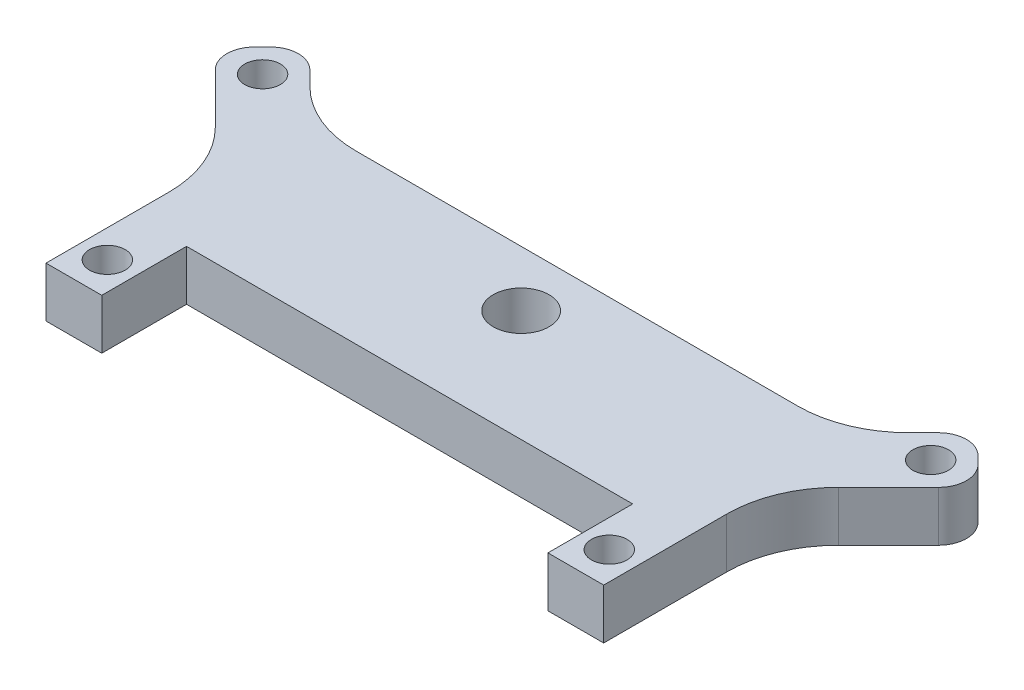
ISO-10303-21;
HEADER;
FILE_DESCRIPTION(('STEP AP214'),'2;1');
FILE_NAME('part.step','',(''),(''),'','','');
FILE_SCHEMA(('AUTOMOTIVE_DESIGN { 1 0 10303 214 1 1 1 1 }'));
ENDSEC;
DATA;
#1=APPLICATION_CONTEXT('core data for automotive mechanical design processes');
#2=APPLICATION_PROTOCOL_DEFINITION('international standard','automotive_design',2000,#1);
#3=PRODUCT_CONTEXT('',#1,'mechanical');
#4=PRODUCT('Part','Part','',(#3));
#5=PRODUCT_RELATED_PRODUCT_CATEGORY('part','',(#4));
#6=PRODUCT_DEFINITION_FORMATION('','',#4);
#7=PRODUCT_DEFINITION_CONTEXT('part definition',#1,'design');
#8=PRODUCT_DEFINITION('design','',#6,#7);
#9=PRODUCT_DEFINITION_SHAPE('','',#8);
#10=(LENGTH_UNIT() NAMED_UNIT(*) SI_UNIT(.MILLI.,.METRE.));
#11=(NAMED_UNIT(*) PLANE_ANGLE_UNIT() SI_UNIT($,.RADIAN.));
#12=(NAMED_UNIT(*) SI_UNIT($,.STERADIAN.) SOLID_ANGLE_UNIT());
#13=UNCERTAINTY_MEASURE_WITH_UNIT(LENGTH_MEASURE(1.E-05),#10,'distance_accuracy_value','');
#14=(GEOMETRIC_REPRESENTATION_CONTEXT(3) GLOBAL_UNCERTAINTY_ASSIGNED_CONTEXT((#13)) GLOBAL_UNIT_ASSIGNED_CONTEXT((#10,
#11,#12)) REPRESENTATION_CONTEXT('',''));
#15=CARTESIAN_POINT('',(0.,0.,0.));
#16=DIRECTION('',(0.,0.,1.));
#17=DIRECTION('',(1.,0.,0.));
#18=AXIS2_PLACEMENT_3D('',#15,#16,#17);
#19=CARTESIAN_POINT('',(0.,4.5,0.));
#20=DIRECTION('',(0.,-1.,0.));
#21=DIRECTION('',(0.,0.,-1.));
#22=AXIS2_PLACEMENT_3D('',#19,#20,#21);
#23=PLANE('',#22);
#24=DIRECTION('',(-0.707106781186549,0.,0.707106781186546));
#25=VECTOR('',#24,1.);
#26=CARTESIAN_POINT('',(-29.9497474683061,4.5,-21.0104076400856));
#27=LINE('',#26,#25);
#28=CARTESIAN_POINT('',(-31.7175144212725,4.5,-19.2426406871193));
#29=VERTEX_POINT('',#28);
#30=CARTESIAN_POINT('',(-32.424621202459,4.5,-18.5355339059327));
#31=VERTEX_POINT('',#30);
#32=EDGE_CURVE('E516',#29,#31,#27,.T.);
#33=ORIENTED_EDGE('',*,*,#32,.T.);
#34=CARTESIAN_POINT('',(-30.6568542494927,4.5,-16.7677669529663));
#35=DIRECTION('',(0.,-1.,0.));
#36=DIRECTION('',(0.,0.,-1.));
#37=AXIS2_PLACEMENT_3D('',#34,#35,#36);
#38=CIRCLE('',#37,2.5);
#39=CARTESIAN_POINT('',(-32.424621202459,4.5,-15.));
#40=VERTEX_POINT('',#39);
#41=EDGE_CURVE('E315',#31,#40,#38,.F.);
#42=ORIENTED_EDGE('',*,*,#41,.T.);
#43=DIRECTION('',(0.707106781186546,0.,0.707106781186549));
#44=VECTOR('',#43,1.);
#45=CARTESIAN_POINT('',(-34.1923881554254,4.5,-16.7677669529664));
#46=LINE('',#45,#44);
#47=CARTESIAN_POINT('',(-27.9289321881346,4.5,-10.5043109856756));
#48=VERTEX_POINT('',#47);
#49=EDGE_CURVE('E522',#40,#48,#46,.T.);
#50=ORIENTED_EDGE('',*,*,#49,.T.);
#51=CARTESIAN_POINT('',(-35.0000000000001,4.5,-3.43324317381012));
#52=DIRECTION('',(0.,-1.,0.));
#53=DIRECTION('',(0.,0.,-1.));
#54=AXIS2_PLACEMENT_3D('',#51,#52,#53);
#55=CIRCLE('',#54,10.);
#56=CARTESIAN_POINT('',(-25.0000000000001,4.5,-3.43324317381051));
#57=VERTEX_POINT('',#56);
#58=EDGE_CURVE('E275',#48,#57,#55,.T.);
#59=ORIENTED_EDGE('',*,*,#58,.T.);
#60=DIRECTION('',(0.,0.,1.));
#61=VECTOR('',#60,1.);
#62=CARTESIAN_POINT('',(-25.0000000000003,4.5,-7.57537879754122));
#63=LINE('',#62,#61);
#64=CARTESIAN_POINT('',(-24.9999999999997,4.5,7.60000000000024));
#65=VERTEX_POINT('',#64);
#66=EDGE_CURVE('E527',#57,#65,#63,.T.);
#67=ORIENTED_EDGE('',*,*,#66,.T.);
#68=DIRECTION('',(1.,0.,0.));
#69=VECTOR('',#68,1.);
#70=CARTESIAN_POINT('',(-24.9999999999997,4.5,7.60000000000024));
#71=LINE('',#70,#69);
#72=CARTESIAN_POINT('',(-20.,4.5,7.60000000000007));
#73=VERTEX_POINT('',#72);
#74=EDGE_CURVE('E210',#65,#73,#71,.T.);
#75=ORIENTED_EDGE('',*,*,#74,.T.);
#76=DIRECTION('',(0.,0.,-1.));
#77=VECTOR('',#76,1.);
#78=CARTESIAN_POINT('',(-20.,4.5,7.60000000000007));
#79=LINE('',#78,#77);
#80=CARTESIAN_POINT('',(-20.,4.5,0.));
#81=VERTEX_POINT('',#80);
#82=EDGE_CURVE('E204',#73,#81,#79,.T.);
#83=ORIENTED_EDGE('',*,*,#82,.T.);
#84=DIRECTION('',(1.,0.,0.));
#85=VECTOR('',#84,1.);
#86=CARTESIAN_POINT('',(-20.,4.5,0.));
#87=LINE('',#86,#85);
#88=CARTESIAN_POINT('',(20.,4.5,0.));
#89=VERTEX_POINT('',#88);
#90=EDGE_CURVE('E193',#81,#89,#87,.T.);
#91=ORIENTED_EDGE('',*,*,#90,.T.);
#92=DIRECTION('',(0.,0.,1.));
#93=VECTOR('',#92,1.);
#94=CARTESIAN_POINT('',(20.,4.5,0.));
#95=LINE('',#94,#93);
#96=CARTESIAN_POINT('',(20.,4.5,7.60000000000011));
#97=VERTEX_POINT('',#96);
#98=EDGE_CURVE('E203',#89,#97,#95,.T.);
#99=ORIENTED_EDGE('',*,*,#98,.T.);
#100=DIRECTION('',(1.,0.,0.));
#101=VECTOR('',#100,1.);
#102=CARTESIAN_POINT('',(20.,4.5,7.60000000000011));
#103=LINE('',#102,#101);
#104=CARTESIAN_POINT('',(25.,4.5,7.60000000000008));
#105=VERTEX_POINT('',#104);
#106=EDGE_CURVE('E404',#97,#105,#103,.T.);
#107=ORIENTED_EDGE('',*,*,#106,.T.);
#108=DIRECTION('',(0.,0.,-1.));
#109=VECTOR('',#108,1.);
#110=CARTESIAN_POINT('',(25.,4.5,7.60000000000008));
#111=LINE('',#110,#109);
#112=CARTESIAN_POINT('',(25.,4.5,-3.43324317380999));
#113=VERTEX_POINT('',#112);
#114=EDGE_CURVE('E545',#105,#113,#111,.T.);
#115=ORIENTED_EDGE('',*,*,#114,.T.);
#116=CARTESIAN_POINT('',(35.,4.5,-3.43324317380999));
#117=DIRECTION('',(0.,-1.,0.));
#118=DIRECTION('',(0.,0.,-1.));
#119=AXIS2_PLACEMENT_3D('',#116,#117,#118);
#120=CIRCLE('',#119,10.);
#121=CARTESIAN_POINT('',(27.9289321881345,4.5,-10.5043109856755));
#122=VERTEX_POINT('',#121);
#123=EDGE_CURVE('E281',#113,#122,#120,.T.);
#124=ORIENTED_EDGE('',*,*,#123,.T.);
#125=DIRECTION('',(0.707106781186549,0.,-0.707106781186546));
#126=VECTOR('',#125,1.);
#127=CARTESIAN_POINT('',(25.,4.5,-7.57537879754096));
#128=LINE('',#127,#126);
#129=CARTESIAN_POINT('',(32.4246212024591,4.5,-15.));
#130=VERTEX_POINT('',#129);
#131=EDGE_CURVE('E343',#122,#130,#128,.T.);
#132=ORIENTED_EDGE('',*,*,#131,.T.);
#133=CARTESIAN_POINT('',(30.6568542494927,4.5,-16.7677669529663));
#134=DIRECTION('',(0.,-1.,0.));
#135=DIRECTION('',(0.,0.,-1.));
#136=AXIS2_PLACEMENT_3D('',#133,#134,#135);
#137=CIRCLE('',#136,2.5);
#138=CARTESIAN_POINT('',(32.4246212024591,4.5,-18.5355339059327));
#139=VERTEX_POINT('',#138);
#140=EDGE_CURVE('E307',#130,#139,#137,.F.);
#141=ORIENTED_EDGE('',*,*,#140,.T.);
#142=DIRECTION('',(-0.707106781186545,0.,-0.707106781186549));
#143=VECTOR('',#142,1.);
#144=CARTESIAN_POINT('',(34.1923881554254,4.5,-16.7677669529663));
#145=LINE('',#144,#143);
#146=CARTESIAN_POINT('',(31.7175144212725,4.5,-19.2426406871193));
#147=VERTEX_POINT('',#146);
#148=EDGE_CURVE('E334',#139,#147,#145,.T.);
#149=ORIENTED_EDGE('',*,*,#148,.T.);
#150=CARTESIAN_POINT('',(29.9497474683061,4.5,-17.4748737341529));
#151=DIRECTION('',(0.,-1.,0.));
#152=DIRECTION('',(0.,0.,-1.));
#153=AXIS2_PLACEMENT_3D('',#150,#151,#152);
#154=CIRCLE('',#153,2.5);
#155=CARTESIAN_POINT('',(28.1819805153398,4.5,-19.2426406871193));
#156=VERTEX_POINT('',#155);
#157=EDGE_CURVE('E65',#147,#156,#154,.F.);
#158=ORIENTED_EDGE('',*,*,#157,.T.);
#159=DIRECTION('',(-0.707106781186549,0.,0.707106781186546));
#160=VECTOR('',#159,1.);
#161=CARTESIAN_POINT('',(29.9497474683062,4.5,-21.0104076400856));
#162=LINE('',#161,#160);
#163=CARTESIAN_POINT('',(26.868272016355,4.5,-17.9289321881345));
#164=VERTEX_POINT('',#163);
#165=EDGE_CURVE('E342',#156,#164,#162,.T.);
#166=ORIENTED_EDGE('',*,*,#165,.T.);
#167=CARTESIAN_POINT('',(19.7972042044895,4.5,-25.));
#168=DIRECTION('',(0.,-1.,0.));
#169=DIRECTION('',(0.,0.,-1.));
#170=AXIS2_PLACEMENT_3D('',#167,#168,#169);
#171=CIRCLE('',#170,10.);
#172=CARTESIAN_POINT('',(19.7972042044895,4.5,-15.));
#173=VERTEX_POINT('',#172);
#174=EDGE_CURVE('E268',#164,#173,#171,.T.);
#175=ORIENTED_EDGE('',*,*,#174,.T.);
#176=DIRECTION('',(-1.,0.,0.));
#177=VECTOR('',#176,1.);
#178=CARTESIAN_POINT('',(23.9393398282205,4.5,-15.));
#179=LINE('',#178,#177);
#180=CARTESIAN_POINT('',(-19.7972042044895,4.5,-15.));
#181=VERTEX_POINT('',#180);
#182=EDGE_CURVE('E529',#173,#181,#179,.T.);
#183=ORIENTED_EDGE('',*,*,#182,.T.);
#184=CARTESIAN_POINT('',(-19.7972042044895,4.5,-25.));
#185=DIRECTION('',(0.,-1.,0.));
#186=DIRECTION('',(0.,0.,-1.));
#187=AXIS2_PLACEMENT_3D('',#184,#185,#186);
#188=CIRCLE('',#187,10.);
#189=CARTESIAN_POINT('',(-26.868272016355,4.5,-17.9289321881345));
#190=VERTEX_POINT('',#189);
#191=EDGE_CURVE('E261',#181,#190,#188,.T.);
#192=ORIENTED_EDGE('',*,*,#191,.T.);
#193=DIRECTION('',(-0.707106781186546,0.,-0.707106781186549));
#194=VECTOR('',#193,1.);
#195=CARTESIAN_POINT('',(-23.9393398282205,4.5,-15.));
#196=LINE('',#195,#194);
#197=CARTESIAN_POINT('',(-28.1819805153397,4.5,-19.2426406871193));
#198=VERTEX_POINT('',#197);
#199=EDGE_CURVE('E518',#190,#198,#196,.T.);
#200=ORIENTED_EDGE('',*,*,#199,.T.);
#201=CARTESIAN_POINT('',(-29.9497474683061,4.5,-17.4748737341529));
#202=DIRECTION('',(0.,-1.,0.));
#203=DIRECTION('',(0.,0.,-1.));
#204=AXIS2_PLACEMENT_3D('',#201,#202,#203);
#205=CIRCLE('',#204,2.5);
#206=EDGE_CURVE('E312',#198,#29,#205,.F.);
#207=ORIENTED_EDGE('',*,*,#206,.T.);
#208=EDGE_LOOP('',(#33,#42,#50,#59,#67,#75,#83,#91,#99,#107,#115,#124,#132,#141,#149,#158,#166,
#175,#183,#192,#200,#207));
#209=FACE_BOUND('',#208,.T.);
#210=CARTESIAN_POINT('',(-22.5,4.5,4.60000000000011));
#211=DIRECTION('',(0.,1.,0.));
#212=DIRECTION('',(0.,0.,1.));
#213=AXIS2_PLACEMENT_3D('',#210,#211,#212);
#214=CIRCLE('',#213,1.60000000000004);
#215=CARTESIAN_POINT('',(-22.5,4.5,6.20000000000015));
#216=VERTEX_POINT('',#215);
#217=EDGE_CURVE('E538',#216,#216,#214,.T.);
#218=ORIENTED_EDGE('',*,*,#217,.F.);
#219=EDGE_LOOP('',(#218));
#220=FACE_BOUND('',#219,.T.);
#221=CARTESIAN_POINT('',(22.5,4.5,4.6));
#222=DIRECTION('',(0.,1.,0.));
#223=DIRECTION('',(0.,0.,1.));
#224=AXIS2_PLACEMENT_3D('',#221,#222,#223);
#225=CIRCLE('',#224,1.60000000000001);
#226=CARTESIAN_POINT('',(22.5,4.5,6.20000000000001));
#227=VERTEX_POINT('',#226);
#228=EDGE_CURVE('E600',#227,#227,#225,.T.);
#229=ORIENTED_EDGE('',*,*,#228,.F.);
#230=EDGE_LOOP('',(#229));
#231=FACE_BOUND('',#230,.T.);
#232=CARTESIAN_POINT('',(29.9497474683061,4.5,-16.7677669529664));
#233=DIRECTION('',(0.,1.,0.));
#234=DIRECTION('',(0.,0.,1.));
#235=AXIS2_PLACEMENT_3D('',#232,#233,#234);
#236=CIRCLE('',#235,1.59999999999999);
#237=CARTESIAN_POINT('',(29.9497474683061,4.5,-15.1677669529664));
#238=VERTEX_POINT('',#237);
#239=EDGE_CURVE('E610',#238,#238,#236,.T.);
#240=ORIENTED_EDGE('',*,*,#239,.F.);
#241=EDGE_LOOP('',(#240));
#242=FACE_BOUND('',#241,.T.);
#243=CARTESIAN_POINT('',(0.,4.5,-10.));
#244=DIRECTION('',(0.,1.,0.));
#245=DIRECTION('',(0.,0.,1.));
#246=AXIS2_PLACEMENT_3D('',#243,#244,#245);
#247=CIRCLE('',#246,2.5);
#248=CARTESIAN_POINT('',(0.,4.5,-7.5));
#249=VERTEX_POINT('',#248);
#250=EDGE_CURVE('E620',#249,#249,#247,.T.);
#251=ORIENTED_EDGE('',*,*,#250,.F.);
#252=EDGE_LOOP('',(#251));
#253=FACE_BOUND('',#252,.T.);
#254=CARTESIAN_POINT('',(-29.9497474683061,4.5,-16.7677669529664));
#255=DIRECTION('',(0.,1.,0.));
#256=DIRECTION('',(0.,0.,1.));
#257=AXIS2_PLACEMENT_3D('',#254,#255,#256);
#258=CIRCLE('',#257,1.6);
#259=CARTESIAN_POINT('',(-29.9497474683061,4.5,-15.1677669529663));
#260=VERTEX_POINT('',#259);
#261=EDGE_CURVE('E630',#260,#260,#258,.T.);
#262=ORIENTED_EDGE('',*,*,#261,.F.);
#263=EDGE_LOOP('',(#262));
#264=FACE_BOUND('',#263,.T.);
#265=ADVANCED_FACE('F41',(#209,#220,#231,#242,#253,#264),#23,.F.);
#266=CARTESIAN_POINT('',(0.,0.,0.));
#267=DIRECTION('',(0.,-1.,0.));
#268=DIRECTION('',(0.,0.,-1.));
#269=AXIS2_PLACEMENT_3D('',#266,#267,#268);
#270=PLANE('',#269);
#271=CARTESIAN_POINT('',(0.,0.,-10.));
#272=DIRECTION('',(0.,1.,0.));
#273=DIRECTION('',(0.,0.,1.));
#274=AXIS2_PLACEMENT_3D('',#271,#272,#273);
#275=CIRCLE('',#274,2.5);
#276=CARTESIAN_POINT('',(0.,0.,-7.5));
#277=VERTEX_POINT('',#276);
#278=EDGE_CURVE('E625',#277,#277,#275,.T.);
#279=ORIENTED_EDGE('',*,*,#278,.T.);
#280=EDGE_LOOP('',(#279));
#281=FACE_BOUND('',#280,.T.);
#282=CARTESIAN_POINT('',(22.5,0.,4.6));
#283=DIRECTION('',(0.,1.,0.));
#284=DIRECTION('',(0.,0.,1.));
#285=AXIS2_PLACEMENT_3D('',#282,#283,#284);
#286=CIRCLE('',#285,1.60000000000001);
#287=CARTESIAN_POINT('',(22.5,0.,6.20000000000001));
#288=VERTEX_POINT('',#287);
#289=EDGE_CURVE('E605',#288,#288,#286,.T.);
#290=ORIENTED_EDGE('',*,*,#289,.T.);
#291=EDGE_LOOP('',(#290));
#292=FACE_BOUND('',#291,.T.);
#293=DIRECTION('',(0.707106781186546,0.,0.707106781186549));
#294=VECTOR('',#293,1.);
#295=CARTESIAN_POINT('',(-34.1923881554254,0.,-16.7677669529664));
#296=LINE('',#295,#294);
#297=CARTESIAN_POINT('',(-32.424621202459,0.,-15.));
#298=VERTEX_POINT('',#297);
#299=CARTESIAN_POINT('',(-27.9289321881346,0.,-10.5043109856756));
#300=VERTEX_POINT('',#299);
#301=EDGE_CURVE('E376',#298,#300,#296,.T.);
#302=ORIENTED_EDGE('',*,*,#301,.F.);
#303=CARTESIAN_POINT('',(-30.6568542494927,0.,-16.7677669529663));
#304=DIRECTION('',(0.,-1.,0.));
#305=DIRECTION('',(0.,0.,-1.));
#306=AXIS2_PLACEMENT_3D('',#303,#304,#305);
#307=CIRCLE('',#306,2.5);
#308=CARTESIAN_POINT('',(-32.424621202459,0.,-18.5355339059327));
#309=VERTEX_POINT('',#308);
#310=EDGE_CURVE('E297',#298,#309,#307,.T.);
#311=ORIENTED_EDGE('',*,*,#310,.T.);
#312=DIRECTION('',(-0.707106781186549,0.,0.707106781186546));
#313=VECTOR('',#312,1.);
#314=CARTESIAN_POINT('',(-29.9497474683061,0.,-21.0104076400856));
#315=LINE('',#314,#313);
#316=CARTESIAN_POINT('',(-31.7175144212725,0.,-19.2426406871193));
#317=VERTEX_POINT('',#316);
#318=EDGE_CURVE('E372',#317,#309,#315,.T.);
#319=ORIENTED_EDGE('',*,*,#318,.F.);
#320=CARTESIAN_POINT('',(-29.9497474683061,0.,-17.4748737341529));
#321=DIRECTION('',(0.,-1.,0.));
#322=DIRECTION('',(0.,0.,-1.));
#323=AXIS2_PLACEMENT_3D('',#320,#321,#322);
#324=CIRCLE('',#323,2.5);
#325=CARTESIAN_POINT('',(-28.1819805153397,0.,-19.2426406871193));
#326=VERTEX_POINT('',#325);
#327=EDGE_CURVE('E294',#317,#326,#324,.T.);
#328=ORIENTED_EDGE('',*,*,#327,.T.);
#329=DIRECTION('',(-0.707106781186546,0.,-0.707106781186549));
#330=VECTOR('',#329,1.);
#331=CARTESIAN_POINT('',(-23.9393398282205,0.,-15.));
#332=LINE('',#331,#330);
#333=CARTESIAN_POINT('',(-26.868272016355,0.,-17.9289321881345));
#334=VERTEX_POINT('',#333);
#335=EDGE_CURVE('E364',#334,#326,#332,.T.);
#336=ORIENTED_EDGE('',*,*,#335,.F.);
#337=CARTESIAN_POINT('',(-19.7972042044895,0.,-25.));
#338=DIRECTION('',(0.,-1.,0.));
#339=DIRECTION('',(0.,0.,-1.));
#340=AXIS2_PLACEMENT_3D('',#337,#338,#339);
#341=CIRCLE('',#340,10.);
#342=CARTESIAN_POINT('',(-19.7972042044895,0.,-15.));
#343=VERTEX_POINT('',#342);
#344=EDGE_CURVE('E258',#334,#343,#341,.F.);
#345=ORIENTED_EDGE('',*,*,#344,.T.);
#346=DIRECTION('',(-1.,0.,0.));
#347=VECTOR('',#346,1.);
#348=CARTESIAN_POINT('',(23.9393398282205,0.,-15.));
#349=LINE('',#348,#347);
#350=CARTESIAN_POINT('',(19.7972042044895,0.,-15.));
#351=VERTEX_POINT('',#350);
#352=EDGE_CURVE('E358',#351,#343,#349,.T.);
#353=ORIENTED_EDGE('',*,*,#352,.F.);
#354=CARTESIAN_POINT('',(19.7972042044895,0.,-25.));
#355=DIRECTION('',(0.,-1.,0.));
#356=DIRECTION('',(0.,0.,-1.));
#357=AXIS2_PLACEMENT_3D('',#354,#355,#356);
#358=CIRCLE('',#357,10.);
#359=CARTESIAN_POINT('',(26.868272016355,0.,-17.9289321881345));
#360=VERTEX_POINT('',#359);
#361=EDGE_CURVE('E264',#351,#360,#358,.F.);
#362=ORIENTED_EDGE('',*,*,#361,.T.);
#363=DIRECTION('',(-0.707106781186549,0.,0.707106781186546));
#364=VECTOR('',#363,1.);
#365=CARTESIAN_POINT('',(29.9497474683062,0.,-21.0104076400856));
#366=LINE('',#365,#364);
#367=CARTESIAN_POINT('',(28.1819805153398,0.,-19.2426406871193));
#368=VERTEX_POINT('',#367);
#369=EDGE_CURVE('E350',#368,#360,#366,.T.);
#370=ORIENTED_EDGE('',*,*,#369,.F.);
#371=CARTESIAN_POINT('',(29.9497474683061,0.,-17.4748737341529));
#372=DIRECTION('',(0.,-1.,0.));
#373=DIRECTION('',(0.,0.,-1.));
#374=AXIS2_PLACEMENT_3D('',#371,#372,#373);
#375=CIRCLE('',#374,2.5);
#376=CARTESIAN_POINT('',(31.7175144212725,0.,-19.2426406871193));
#377=VERTEX_POINT('',#376);
#378=EDGE_CURVE('E291',#368,#377,#375,.T.);
#379=ORIENTED_EDGE('',*,*,#378,.T.);
#380=DIRECTION('',(-0.707106781186545,0.,-0.707106781186549));
#381=VECTOR('',#380,1.);
#382=CARTESIAN_POINT('',(34.1923881554254,0.,-16.7677669529663));
#383=LINE('',#382,#381);
#384=CARTESIAN_POINT('',(32.4246212024591,0.,-18.5355339059327));
#385=VERTEX_POINT('',#384);
#386=EDGE_CURVE('E337',#385,#377,#383,.T.);
#387=ORIENTED_EDGE('',*,*,#386,.F.);
#388=CARTESIAN_POINT('',(30.6568542494927,0.,-16.7677669529663));
#389=DIRECTION('',(0.,-1.,0.));
#390=DIRECTION('',(0.,0.,-1.));
#391=AXIS2_PLACEMENT_3D('',#388,#389,#390);
#392=CIRCLE('',#391,2.5);
#393=CARTESIAN_POINT('',(32.4246212024591,0.,-15.));
#394=VERTEX_POINT('',#393);
#395=EDGE_CURVE('E288',#385,#394,#392,.T.);
#396=ORIENTED_EDGE('',*,*,#395,.T.);
#397=DIRECTION('',(0.707106781186549,0.,-0.707106781186546));
#398=VECTOR('',#397,1.);
#399=CARTESIAN_POINT('',(25.,0.,-7.57537879754096));
#400=LINE('',#399,#398);
#401=CARTESIAN_POINT('',(27.9289321881345,0.,-10.5043109856755));
#402=VERTEX_POINT('',#401);
#403=EDGE_CURVE('E366',#402,#394,#400,.T.);
#404=ORIENTED_EDGE('',*,*,#403,.F.);
#405=CARTESIAN_POINT('',(35.,0.,-3.43324317380999));
#406=DIRECTION('',(0.,-1.,0.));
#407=DIRECTION('',(0.,0.,-1.));
#408=AXIS2_PLACEMENT_3D('',#405,#406,#407);
#409=CIRCLE('',#408,10.);
#410=CARTESIAN_POINT('',(25.,0.,-3.43324317380999));
#411=VERTEX_POINT('',#410);
#412=EDGE_CURVE('E278',#402,#411,#409,.F.);
#413=ORIENTED_EDGE('',*,*,#412,.T.);
#414=DIRECTION('',(0.,0.,-1.));
#415=VECTOR('',#414,1.);
#416=CARTESIAN_POINT('',(25.,0.,7.60000000000008));
#417=LINE('',#416,#415);
#418=CARTESIAN_POINT('',(25.,0.,7.60000000000008));
#419=VERTEX_POINT('',#418);
#420=EDGE_CURVE('E410',#419,#411,#417,.T.);
#421=ORIENTED_EDGE('',*,*,#420,.F.);
#422=DIRECTION('',(1.,0.,0.));
#423=VECTOR('',#422,1.);
#424=CARTESIAN_POINT('',(20.,0.,7.60000000000011));
#425=LINE('',#424,#423);
#426=CARTESIAN_POINT('',(20.,0.,7.60000000000011));
#427=VERTEX_POINT('',#426);
#428=EDGE_CURVE('E403',#427,#419,#425,.T.);
#429=ORIENTED_EDGE('',*,*,#428,.F.);
#430=DIRECTION('',(0.,0.,1.));
#431=VECTOR('',#430,1.);
#432=CARTESIAN_POINT('',(20.,0.,0.));
#433=LINE('',#432,#431);
#434=CARTESIAN_POINT('',(20.,0.,0.));
#435=VERTEX_POINT('',#434);
#436=EDGE_CURVE('E408',#435,#427,#433,.T.);
#437=ORIENTED_EDGE('',*,*,#436,.F.);
#438=DIRECTION('',(1.,0.,0.));
#439=VECTOR('',#438,1.);
#440=CARTESIAN_POINT('',(-20.,0.,0.));
#441=LINE('',#440,#439);
#442=CARTESIAN_POINT('',(-20.,0.,0.));
#443=VERTEX_POINT('',#442);
#444=EDGE_CURVE('E417',#443,#435,#441,.T.);
#445=ORIENTED_EDGE('',*,*,#444,.F.);
#446=DIRECTION('',(0.,0.,-1.));
#447=VECTOR('',#446,1.);
#448=CARTESIAN_POINT('',(-20.,0.,7.60000000000007));
#449=LINE('',#448,#447);
#450=CARTESIAN_POINT('',(-20.,0.,7.60000000000007));
#451=VERTEX_POINT('',#450);
#452=EDGE_CURVE('E219',#451,#443,#449,.T.);
#453=ORIENTED_EDGE('',*,*,#452,.F.);
#454=DIRECTION('',(1.,0.,0.));
#455=VECTOR('',#454,1.);
#456=CARTESIAN_POINT('',(-24.9999999999997,0.,7.60000000000024));
#457=LINE('',#456,#455);
#458=CARTESIAN_POINT('',(-24.9999999999997,0.,7.60000000000024));
#459=VERTEX_POINT('',#458);
#460=EDGE_CURVE('E215',#459,#451,#457,.T.);
#461=ORIENTED_EDGE('',*,*,#460,.F.);
#462=DIRECTION('',(0.,0.,1.));
#463=VECTOR('',#462,1.);
#464=CARTESIAN_POINT('',(-25.0000000000003,0.,-7.57537879754122));
#465=LINE('',#464,#463);
#466=CARTESIAN_POINT('',(-25.0000000000001,0.,-3.43324317381051));
#467=VERTEX_POINT('',#466);
#468=EDGE_CURVE('E379',#467,#459,#465,.T.);
#469=ORIENTED_EDGE('',*,*,#468,.F.);
#470=CARTESIAN_POINT('',(-35.0000000000001,0.,-3.43324317381012));
#471=DIRECTION('',(0.,-1.,0.));
#472=DIRECTION('',(0.,0.,-1.));
#473=AXIS2_PLACEMENT_3D('',#470,#471,#472);
#474=CIRCLE('',#473,10.);
#475=EDGE_CURVE('E271',#467,#300,#474,.F.);
#476=ORIENTED_EDGE('',*,*,#475,.T.);
#477=EDGE_LOOP('',(#302,#311,#319,#328,#336,#345,#353,#362,#370,#379,#387,#396,#404,#413,#421,
#429,#437,#445,#453,#461,#469,#476));
#478=FACE_BOUND('',#477,.T.);
#479=CARTESIAN_POINT('',(-22.5,0.,4.60000000000011));
#480=DIRECTION('',(0.,1.,0.));
#481=DIRECTION('',(0.,0.,1.));
#482=AXIS2_PLACEMENT_3D('',#479,#480,#481);
#483=CIRCLE('',#482,1.60000000000004);
#484=CARTESIAN_POINT('',(-22.5,0.,6.20000000000015));
#485=VERTEX_POINT('',#484);
#486=EDGE_CURVE('E595',#485,#485,#483,.T.);
#487=ORIENTED_EDGE('',*,*,#486,.T.);
#488=EDGE_LOOP('',(#487));
#489=FACE_BOUND('',#488,.T.);
#490=CARTESIAN_POINT('',(29.9497474683061,0.,-16.7677669529664));
#491=DIRECTION('',(0.,1.,0.));
#492=DIRECTION('',(0.,0.,1.));
#493=AXIS2_PLACEMENT_3D('',#490,#491,#492);
#494=CIRCLE('',#493,1.59999999999999);
#495=CARTESIAN_POINT('',(29.9497474683061,0.,-15.1677669529664));
#496=VERTEX_POINT('',#495);
#497=EDGE_CURVE('E615',#496,#496,#494,.T.);
#498=ORIENTED_EDGE('',*,*,#497,.T.);
#499=EDGE_LOOP('',(#498));
#500=FACE_BOUND('',#499,.T.);
#501=CARTESIAN_POINT('',(-29.9497474683061,0.,-16.7677669529664));
#502=DIRECTION('',(0.,1.,0.));
#503=DIRECTION('',(0.,0.,1.));
#504=AXIS2_PLACEMENT_3D('',#501,#502,#503);
#505=CIRCLE('',#504,1.6);
#506=CARTESIAN_POINT('',(-29.9497474683061,0.,-15.1677669529663));
#507=VERTEX_POINT('',#506);
#508=EDGE_CURVE('E635',#507,#507,#505,.T.);
#509=ORIENTED_EDGE('',*,*,#508,.T.);
#510=EDGE_LOOP('',(#509));
#511=FACE_BOUND('',#510,.T.);
#512=ADVANCED_FACE('F353',(#281,#292,#478,#489,#500,#511),#270,.T.);
#513=CARTESIAN_POINT('',(-20.,4.5,7.60000000000007));
#514=DIRECTION('',(-1.,0.,0.));
#515=DIRECTION('',(0.,0.,1.));
#516=AXIS2_PLACEMENT_3D('',#513,#514,#515);
#517=PLANE('',#516);
#518=ORIENTED_EDGE('',*,*,#452,.T.);
#519=DIRECTION('',(0.,-1.,0.));
#520=VECTOR('',#519,1.);
#521=CARTESIAN_POINT('',(-20.,4.5,0.));
#522=LINE('',#521,#520);
#523=EDGE_CURVE('E197',#81,#443,#522,.T.);
#524=ORIENTED_EDGE('',*,*,#523,.F.);
#525=ORIENTED_EDGE('',*,*,#82,.F.);
#526=DIRECTION('',(0.,-1.,0.));
#527=VECTOR('',#526,1.);
#528=CARTESIAN_POINT('',(-20.,4.5,7.60000000000007));
#529=LINE('',#528,#527);
#530=EDGE_CURVE('E384',#73,#451,#529,.T.);
#531=ORIENTED_EDGE('',*,*,#530,.T.);
#532=EDGE_LOOP('',(#518,#524,#525,#531));
#533=FACE_BOUND('',#532,.T.);
#534=ADVANCED_FACE('F217',(#533),#517,.F.);
#535=CARTESIAN_POINT('',(-20.,4.5,0.));
#536=DIRECTION('',(0.,0.,-1.));
#537=DIRECTION('',(-1.,0.,0.));
#538=AXIS2_PLACEMENT_3D('',#535,#536,#537);
#539=PLANE('',#538);
#540=ORIENTED_EDGE('',*,*,#444,.T.);
#541=DIRECTION('',(0.,-1.,0.));
#542=VECTOR('',#541,1.);
#543=CARTESIAN_POINT('',(20.,4.5,0.));
#544=LINE('',#543,#542);
#545=EDGE_CURVE('E200',#89,#435,#544,.T.);
#546=ORIENTED_EDGE('',*,*,#545,.F.);
#547=ORIENTED_EDGE('',*,*,#90,.F.);
#548=ORIENTED_EDGE('',*,*,#523,.T.);
#549=EDGE_LOOP('',(#540,#546,#547,#548));
#550=FACE_BOUND('',#549,.T.);
#551=ADVANCED_FACE('F195',(#550),#539,.F.);
#552=CARTESIAN_POINT('',(20.,4.5,0.));
#553=DIRECTION('',(1.,0.,0.));
#554=DIRECTION('',(0.,0.,-1.));
#555=AXIS2_PLACEMENT_3D('',#552,#553,#554);
#556=PLANE('',#555);
#557=ORIENTED_EDGE('',*,*,#436,.T.);
#558=DIRECTION('',(0.,-1.,0.));
#559=VECTOR('',#558,1.);
#560=CARTESIAN_POINT('',(20.,4.5,7.60000000000011));
#561=LINE('',#560,#559);
#562=EDGE_CURVE('E229',#97,#427,#561,.T.);
#563=ORIENTED_EDGE('',*,*,#562,.F.);
#564=ORIENTED_EDGE('',*,*,#98,.F.);
#565=ORIENTED_EDGE('',*,*,#545,.T.);
#566=EDGE_LOOP('',(#557,#563,#564,#565));
#567=FACE_BOUND('',#566,.T.);
#568=ADVANCED_FACE('F481',(#567),#556,.F.);
#569=CARTESIAN_POINT('',(20.,4.5,7.60000000000011));
#570=DIRECTION('',(0.,0.,-1.));
#571=DIRECTION('',(-1.,0.,0.));
#572=AXIS2_PLACEMENT_3D('',#569,#570,#571);
#573=PLANE('',#572);
#574=ORIENTED_EDGE('',*,*,#428,.T.);
#575=DIRECTION('',(0.,-1.,0.));
#576=VECTOR('',#575,1.);
#577=CARTESIAN_POINT('',(25.,4.5,7.60000000000008));
#578=LINE('',#577,#576);
#579=EDGE_CURVE('E391',#105,#419,#578,.T.);
#580=ORIENTED_EDGE('',*,*,#579,.F.);
#581=ORIENTED_EDGE('',*,*,#106,.F.);
#582=ORIENTED_EDGE('',*,*,#562,.T.);
#583=EDGE_LOOP('',(#574,#580,#581,#582));
#584=FACE_BOUND('',#583,.T.);
#585=ADVANCED_FACE('F401',(#584),#573,.F.);
#586=CARTESIAN_POINT('',(25.,4.5,7.60000000000008));
#587=DIRECTION('',(-1.,0.,0.));
#588=DIRECTION('',(0.,0.,1.));
#589=AXIS2_PLACEMENT_3D('',#586,#587,#588);
#590=PLANE('',#589);
#591=ORIENTED_EDGE('',*,*,#420,.T.);
#592=DIRECTION('',(0.,-1.,0.));
#593=VECTOR('',#592,1.);
#594=CARTESIAN_POINT('',(25.,4.5,-3.43324317381));
#595=LINE('',#594,#593);
#596=EDGE_CURVE('E255',#411,#113,#595,.F.);
#597=ORIENTED_EDGE('',*,*,#596,.T.);
#598=ORIENTED_EDGE('',*,*,#114,.F.);
#599=ORIENTED_EDGE('',*,*,#579,.T.);
#600=EDGE_LOOP('',(#591,#597,#598,#599));
#601=FACE_BOUND('',#600,.T.);
#602=ADVANCED_FACE('F475',(#601),#590,.F.);
#603=CARTESIAN_POINT('',(25.,4.5,-7.57537879754096));
#604=DIRECTION('',(-0.707106781186546,0.,-0.707106781186549));
#605=DIRECTION('',(-0.707106781186549,0.,0.707106781186546));
#606=AXIS2_PLACEMENT_3D('',#603,#604,#605);
#607=PLANE('',#606);
#608=ORIENTED_EDGE('',*,*,#403,.T.);
#609=DIRECTION('',(0.,-1.,0.));
#610=VECTOR('',#609,1.);
#611=CARTESIAN_POINT('',(32.4246212024591,4.5,-15.));
#612=LINE('',#611,#610);
#613=EDGE_CURVE('E11',#394,#130,#612,.F.);
#614=ORIENTED_EDGE('',*,*,#613,.T.);
#615=ORIENTED_EDGE('',*,*,#131,.F.);
#616=DIRECTION('',(0.,-1.,0.));
#617=VECTOR('',#616,1.);
#618=CARTESIAN_POINT('',(27.9289321881345,0.,-10.5043109856755));
#619=LINE('',#618,#617);
#620=EDGE_CURVE('E251',#122,#402,#619,.T.);
#621=ORIENTED_EDGE('',*,*,#620,.T.);
#622=EDGE_LOOP('',(#608,#614,#615,#621));
#623=FACE_BOUND('',#622,.T.);
#624=ADVANCED_FACE('F426',(#623),#607,.F.);
#625=CARTESIAN_POINT('',(34.1923881554254,4.5,-16.7677669529663));
#626=DIRECTION('',(-0.707106781186549,0.,0.707106781186545));
#627=DIRECTION('',(0.707106781186546,0.,0.70710678118655));
#628=AXIS2_PLACEMENT_3D('',#625,#626,#627);
#629=PLANE('',#628);
#630=ORIENTED_EDGE('',*,*,#386,.T.);
#631=DIRECTION('',(0.,-1.,0.));
#632=VECTOR('',#631,1.);
#633=CARTESIAN_POINT('',(31.7175144212725,4.5,-19.2426406871193));
#634=LINE('',#633,#632);
#635=EDGE_CURVE('E50',#377,#147,#634,.F.);
#636=ORIENTED_EDGE('',*,*,#635,.T.);
#637=ORIENTED_EDGE('',*,*,#148,.F.);
#638=DIRECTION('',(0.,-1.,0.));
#639=VECTOR('',#638,1.);
#640=CARTESIAN_POINT('',(32.4246212024591,4.5,-18.5355339059327));
#641=LINE('',#640,#639);
#642=EDGE_CURVE('E324',#139,#385,#641,.T.);
#643=ORIENTED_EDGE('',*,*,#642,.T.);
#644=EDGE_LOOP('',(#630,#636,#637,#643));
#645=FACE_BOUND('',#644,.T.);
#646=ADVANCED_FACE('F333',(#645),#629,.F.);
#647=CARTESIAN_POINT('',(29.9497474683062,4.5,-21.0104076400856));
#648=DIRECTION('',(0.707106781186546,0.,0.707106781186549));
#649=DIRECTION('',(0.707106781186549,0.,-0.707106781186546));
#650=AXIS2_PLACEMENT_3D('',#647,#648,#649);
#651=PLANE('',#650);
#652=ORIENTED_EDGE('',*,*,#165,.F.);
#653=DIRECTION('',(0.,-1.,0.));
#654=VECTOR('',#653,1.);
#655=CARTESIAN_POINT('',(28.1819805153398,4.5,-19.2426406871193));
#656=LINE('',#655,#654);
#657=EDGE_CURVE('E320',#156,#368,#656,.T.);
#658=ORIENTED_EDGE('',*,*,#657,.T.);
#659=ORIENTED_EDGE('',*,*,#369,.T.);
#660=DIRECTION('',(0.,-1.,0.));
#661=VECTOR('',#660,1.);
#662=CARTESIAN_POINT('',(26.868272016355,4.5,-17.9289321881345));
#663=LINE('',#662,#661);
#664=EDGE_CURVE('E239',#360,#164,#663,.F.);
#665=ORIENTED_EDGE('',*,*,#664,.T.);
#666=EDGE_LOOP('',(#652,#658,#659,#665));
#667=FACE_BOUND('',#666,.T.);
#668=ADVANCED_FACE('F349',(#667),#651,.F.);
#669=CARTESIAN_POINT('',(23.9393398282205,4.5,-15.));
#670=DIRECTION('',(0.,0.,1.));
#671=DIRECTION('',(1.,0.,0.));
#672=AXIS2_PLACEMENT_3D('',#669,#670,#671);
#673=PLANE('',#672);
#674=ORIENTED_EDGE('',*,*,#352,.T.);
#675=DIRECTION('',(0.,-1.,0.));
#676=VECTOR('',#675,1.);
#677=CARTESIAN_POINT('',(-19.7972042044895,4.5,-15.));
#678=LINE('',#677,#676);
#679=EDGE_CURVE('E236',#343,#181,#678,.F.);
#680=ORIENTED_EDGE('',*,*,#679,.T.);
#681=ORIENTED_EDGE('',*,*,#182,.F.);
#682=DIRECTION('',(0.,-1.,0.));
#683=VECTOR('',#682,1.);
#684=CARTESIAN_POINT('',(19.7972042044895,0.,-15.));
#685=LINE('',#684,#683);
#686=EDGE_CURVE('E227',#173,#351,#685,.T.);
#687=ORIENTED_EDGE('',*,*,#686,.T.);
#688=EDGE_LOOP('',(#674,#680,#681,#687));
#689=FACE_BOUND('',#688,.T.);
#690=ADVANCED_FACE('F465',(#689),#673,.F.);
#691=CARTESIAN_POINT('',(-23.9393398282205,4.5,-15.));
#692=DIRECTION('',(-0.707106781186549,0.,0.707106781186546));
#693=DIRECTION('',(0.707106781186546,0.,0.707106781186549));
#694=AXIS2_PLACEMENT_3D('',#691,#692,#693);
#695=PLANE('',#694);
#696=ORIENTED_EDGE('',*,*,#335,.T.);
#697=DIRECTION('',(0.,-1.,0.));
#698=VECTOR('',#697,1.);
#699=CARTESIAN_POINT('',(-28.1819805153397,4.5,-19.2426406871193));
#700=LINE('',#699,#698);
#701=EDGE_CURVE('E57',#326,#198,#700,.F.);
#702=ORIENTED_EDGE('',*,*,#701,.T.);
#703=ORIENTED_EDGE('',*,*,#199,.F.);
#704=DIRECTION('',(0.,-1.,0.));
#705=VECTOR('',#704,1.);
#706=CARTESIAN_POINT('',(-26.868272016355,0.,-17.9289321881345));
#707=LINE('',#706,#705);
#708=EDGE_CURVE('E221',#190,#334,#707,.T.);
#709=ORIENTED_EDGE('',*,*,#708,.T.);
#710=EDGE_LOOP('',(#696,#702,#703,#709));
#711=FACE_BOUND('',#710,.T.);
#712=ADVANCED_FACE('F461',(#711),#695,.F.);
#713=CARTESIAN_POINT('',(-29.9497474683061,4.5,-21.0104076400856));
#714=DIRECTION('',(0.707106781186546,0.,0.707106781186549));
#715=DIRECTION('',(0.707106781186549,0.,-0.707106781186546));
#716=AXIS2_PLACEMENT_3D('',#713,#714,#715);
#717=PLANE('',#716);
#718=ORIENTED_EDGE('',*,*,#318,.T.);
#719=DIRECTION('',(0.,-1.,0.));
#720=VECTOR('',#719,1.);
#721=CARTESIAN_POINT('',(-32.424621202459,4.5,-18.5355339059327));
#722=LINE('',#721,#720);
#723=EDGE_CURVE('E304',#309,#31,#722,.F.);
#724=ORIENTED_EDGE('',*,*,#723,.T.);
#725=ORIENTED_EDGE('',*,*,#32,.F.);
#726=DIRECTION('',(0.,-1.,0.));
#727=VECTOR('',#726,1.);
#728=CARTESIAN_POINT('',(-31.7175144212725,4.5,-19.2426406871193));
#729=LINE('',#728,#727);
#730=EDGE_CURVE('E300',#29,#317,#729,.T.);
#731=ORIENTED_EDGE('',*,*,#730,.T.);
#732=EDGE_LOOP('',(#718,#724,#725,#731));
#733=FACE_BOUND('',#732,.T.);
#734=ADVANCED_FACE('F457',(#733),#717,.F.);
#735=CARTESIAN_POINT('',(-34.1923881554254,4.5,-16.7677669529664));
#736=DIRECTION('',(0.707106781186549,0.,-0.707106781186546));
#737=DIRECTION('',(-0.707106781186546,0.,-0.707106781186549));
#738=AXIS2_PLACEMENT_3D('',#735,#736,#737);
#739=PLANE('',#738);
#740=ORIENTED_EDGE('',*,*,#49,.F.);
#741=DIRECTION('',(0.,-1.,0.));
#742=VECTOR('',#741,1.);
#743=CARTESIAN_POINT('',(-32.424621202459,4.5,-15.));
#744=LINE('',#743,#742);
#745=EDGE_CURVE('E284',#40,#298,#744,.T.);
#746=ORIENTED_EDGE('',*,*,#745,.T.);
#747=ORIENTED_EDGE('',*,*,#301,.T.);
#748=DIRECTION('',(0.,-1.,0.));
#749=VECTOR('',#748,1.);
#750=CARTESIAN_POINT('',(-27.9289321881346,4.5,-10.5043109856756));
#751=LINE('',#750,#749);
#752=EDGE_CURVE('E247',#300,#48,#751,.F.);
#753=ORIENTED_EDGE('',*,*,#752,.T.);
#754=EDGE_LOOP('',(#740,#746,#747,#753));
#755=FACE_BOUND('',#754,.T.);
#756=ADVANCED_FACE('F453',(#755),#739,.F.);
#757=CARTESIAN_POINT('',(-25.0000000000003,4.5,-7.57537879754122));
#758=DIRECTION('',(1.,0.,0.));
#759=DIRECTION('',(0.,0.,-1.));
#760=AXIS2_PLACEMENT_3D('',#757,#758,#759);
#761=PLANE('',#760);
#762=ORIENTED_EDGE('',*,*,#66,.F.);
#763=DIRECTION('',(0.,-1.,0.));
#764=VECTOR('',#763,1.);
#765=CARTESIAN_POINT('',(-25.0000000000001,0.,-3.43324317381051));
#766=LINE('',#765,#764);
#767=EDGE_CURVE('E243',#57,#467,#766,.T.);
#768=ORIENTED_EDGE('',*,*,#767,.T.);
#769=ORIENTED_EDGE('',*,*,#468,.T.);
#770=DIRECTION('',(0.,-1.,0.));
#771=VECTOR('',#770,1.);
#772=CARTESIAN_POINT('',(-24.9999999999997,4.5,7.60000000000024));
#773=LINE('',#772,#771);
#774=EDGE_CURVE('E387',#65,#459,#773,.T.);
#775=ORIENTED_EDGE('',*,*,#774,.F.);
#776=EDGE_LOOP('',(#762,#768,#769,#775));
#777=FACE_BOUND('',#776,.T.);
#778=ADVANCED_FACE('F449',(#777),#761,.F.);
#779=CARTESIAN_POINT('',(-24.9999999999997,4.5,7.60000000000024));
#780=DIRECTION('',(0.,0.,-1.));
#781=DIRECTION('',(-1.,0.,0.));
#782=AXIS2_PLACEMENT_3D('',#779,#780,#781);
#783=PLANE('',#782);
#784=ORIENTED_EDGE('',*,*,#460,.T.);
#785=ORIENTED_EDGE('',*,*,#530,.F.);
#786=ORIENTED_EDGE('',*,*,#74,.F.);
#787=ORIENTED_EDGE('',*,*,#774,.T.);
#788=EDGE_LOOP('',(#784,#785,#786,#787));
#789=FACE_BOUND('',#788,.T.);
#790=ADVANCED_FACE('F446',(#789),#783,.F.);
#791=CARTESIAN_POINT('',(-22.5,4.5,4.60000000000011));
#792=DIRECTION('',(0.,-1.,0.));
#793=DIRECTION('',(0.,0.,-1.));
#794=AXIS2_PLACEMENT_3D('',#791,#792,#793);
#795=CYLINDRICAL_SURFACE('',#794,1.60000000000004);
#796=ORIENTED_EDGE('',*,*,#217,.T.);
#797=EDGE_LOOP('',(#796));
#798=FACE_BOUND('',#797,.T.);
#799=ORIENTED_EDGE('',*,*,#486,.F.);
#800=EDGE_LOOP('',(#799));
#801=FACE_BOUND('',#800,.T.);
#802=ADVANCED_FACE('F443',(#798,#801),#795,.F.);
#803=CARTESIAN_POINT('',(22.5,4.5,4.6));
#804=DIRECTION('',(0.,-1.,0.));
#805=DIRECTION('',(0.,0.,-1.));
#806=AXIS2_PLACEMENT_3D('',#803,#804,#805);
#807=CYLINDRICAL_SURFACE('',#806,1.60000000000001);
#808=ORIENTED_EDGE('',*,*,#228,.T.);
#809=EDGE_LOOP('',(#808));
#810=FACE_BOUND('',#809,.T.);
#811=ORIENTED_EDGE('',*,*,#289,.F.);
#812=EDGE_LOOP('',(#811));
#813=FACE_BOUND('',#812,.T.);
#814=ADVANCED_FACE('F693',(#810,#813),#807,.F.);
#815=CARTESIAN_POINT('',(29.9497474683061,4.5,-16.7677669529664));
#816=DIRECTION('',(0.,-1.,0.));
#817=DIRECTION('',(0.,0.,-1.));
#818=AXIS2_PLACEMENT_3D('',#815,#816,#817);
#819=CYLINDRICAL_SURFACE('',#818,1.59999999999999);
#820=ORIENTED_EDGE('',*,*,#239,.T.);
#821=EDGE_LOOP('',(#820));
#822=FACE_BOUND('',#821,.T.);
#823=ORIENTED_EDGE('',*,*,#497,.F.);
#824=EDGE_LOOP('',(#823));
#825=FACE_BOUND('',#824,.T.);
#826=ADVANCED_FACE('F688',(#822,#825),#819,.F.);
#827=CARTESIAN_POINT('',(0.,4.5,-10.));
#828=DIRECTION('',(0.,-1.,0.));
#829=DIRECTION('',(0.,0.,-1.));
#830=AXIS2_PLACEMENT_3D('',#827,#828,#829);
#831=CYLINDRICAL_SURFACE('',#830,2.5);
#832=ORIENTED_EDGE('',*,*,#250,.T.);
#833=EDGE_LOOP('',(#832));
#834=FACE_BOUND('',#833,.T.);
#835=ORIENTED_EDGE('',*,*,#278,.F.);
#836=EDGE_LOOP('',(#835));
#837=FACE_BOUND('',#836,.T.);
#838=ADVANCED_FACE('F682',(#834,#837),#831,.F.);
#839=CARTESIAN_POINT('',(-29.9497474683061,4.5,-16.7677669529664));
#840=DIRECTION('',(0.,-1.,0.));
#841=DIRECTION('',(0.,0.,-1.));
#842=AXIS2_PLACEMENT_3D('',#839,#840,#841);
#843=CYLINDRICAL_SURFACE('',#842,1.6);
#844=ORIENTED_EDGE('',*,*,#261,.T.);
#845=EDGE_LOOP('',(#844));
#846=FACE_BOUND('',#845,.T.);
#847=ORIENTED_EDGE('',*,*,#508,.F.);
#848=EDGE_LOOP('',(#847));
#849=FACE_BOUND('',#848,.T.);
#850=ADVANCED_FACE('F492',(#846,#849),#843,.F.);
#851=CARTESIAN_POINT('',(-19.7972042044895,4.5,-25.));
#852=DIRECTION('',(0.,1.,0.));
#853=DIRECTION('',(0.,0.,1.));
#854=AXIS2_PLACEMENT_3D('',#851,#852,#853);
#855=CYLINDRICAL_SURFACE('',#854,10.);
#856=ORIENTED_EDGE('',*,*,#191,.F.);
#857=ORIENTED_EDGE('',*,*,#679,.F.);
#858=ORIENTED_EDGE('',*,*,#344,.F.);
#859=ORIENTED_EDGE('',*,*,#708,.F.);
#860=EDGE_LOOP('',(#856,#857,#858,#859));
#861=FACE_BOUND('',#860,.T.);
#862=ADVANCED_FACE('F488',(#861),#855,.F.);
#863=CARTESIAN_POINT('',(19.7972042044895,4.5,-25.));
#864=DIRECTION('',(0.,1.,0.));
#865=DIRECTION('',(0.,0.,1.));
#866=AXIS2_PLACEMENT_3D('',#863,#864,#865);
#867=CYLINDRICAL_SURFACE('',#866,10.);
#868=ORIENTED_EDGE('',*,*,#174,.F.);
#869=ORIENTED_EDGE('',*,*,#664,.F.);
#870=ORIENTED_EDGE('',*,*,#361,.F.);
#871=ORIENTED_EDGE('',*,*,#686,.F.);
#872=EDGE_LOOP('',(#868,#869,#870,#871));
#873=FACE_BOUND('',#872,.T.);
#874=ADVANCED_FACE('F491',(#873),#867,.F.);
#875=CARTESIAN_POINT('',(-35.0000000000001,4.5,-3.43324317381012));
#876=DIRECTION('',(0.,1.,0.));
#877=DIRECTION('',(0.,0.,1.));
#878=AXIS2_PLACEMENT_3D('',#875,#876,#877);
#879=CYLINDRICAL_SURFACE('',#878,10.);
#880=ORIENTED_EDGE('',*,*,#58,.F.);
#881=ORIENTED_EDGE('',*,*,#752,.F.);
#882=ORIENTED_EDGE('',*,*,#475,.F.);
#883=ORIENTED_EDGE('',*,*,#767,.F.);
#884=EDGE_LOOP('',(#880,#881,#882,#883));
#885=FACE_BOUND('',#884,.T.);
#886=ADVANCED_FACE('F496',(#885),#879,.F.);
#887=CARTESIAN_POINT('',(35.,4.5,-3.43324317380999));
#888=DIRECTION('',(0.,1.,0.));
#889=DIRECTION('',(0.,0.,1.));
#890=AXIS2_PLACEMENT_3D('',#887,#888,#889);
#891=CYLINDRICAL_SURFACE('',#890,10.);
#892=ORIENTED_EDGE('',*,*,#123,.F.);
#893=ORIENTED_EDGE('',*,*,#596,.F.);
#894=ORIENTED_EDGE('',*,*,#412,.F.);
#895=ORIENTED_EDGE('',*,*,#620,.F.);
#896=EDGE_LOOP('',(#892,#893,#894,#895));
#897=FACE_BOUND('',#896,.T.);
#898=ADVANCED_FACE('F500',(#897),#891,.F.);
#899=CARTESIAN_POINT('',(-30.6568542494927,4.5,-16.7677669529663));
#900=DIRECTION('',(0.,-1.,0.));
#901=DIRECTION('',(0.,0.,-1.));
#902=AXIS2_PLACEMENT_3D('',#899,#900,#901);
#903=CYLINDRICAL_SURFACE('',#902,2.5);
#904=ORIENTED_EDGE('',*,*,#41,.F.);
#905=ORIENTED_EDGE('',*,*,#723,.F.);
#906=ORIENTED_EDGE('',*,*,#310,.F.);
#907=ORIENTED_EDGE('',*,*,#745,.F.);
#908=EDGE_LOOP('',(#904,#905,#906,#907));
#909=FACE_BOUND('',#908,.T.);
#910=ADVANCED_FACE('F504',(#909),#903,.T.);
#911=CARTESIAN_POINT('',(-29.9497474683061,4.5,-17.4748737341529));
#912=DIRECTION('',(0.,-1.,0.));
#913=DIRECTION('',(0.,0.,-1.));
#914=AXIS2_PLACEMENT_3D('',#911,#912,#913);
#915=CYLINDRICAL_SURFACE('',#914,2.5);
#916=ORIENTED_EDGE('',*,*,#206,.F.);
#917=ORIENTED_EDGE('',*,*,#701,.F.);
#918=ORIENTED_EDGE('',*,*,#327,.F.);
#919=ORIENTED_EDGE('',*,*,#730,.F.);
#920=EDGE_LOOP('',(#916,#917,#918,#919));
#921=FACE_BOUND('',#920,.T.);
#922=ADVANCED_FACE('F434',(#921),#915,.T.);
#923=CARTESIAN_POINT('',(29.9497474683061,4.5,-17.4748737341529));
#924=DIRECTION('',(0.,-1.,0.));
#925=DIRECTION('',(0.,0.,-1.));
#926=AXIS2_PLACEMENT_3D('',#923,#924,#925);
#927=CYLINDRICAL_SURFACE('',#926,2.5);
#928=ORIENTED_EDGE('',*,*,#157,.F.);
#929=ORIENTED_EDGE('',*,*,#635,.F.);
#930=ORIENTED_EDGE('',*,*,#378,.F.);
#931=ORIENTED_EDGE('',*,*,#657,.F.);
#932=EDGE_LOOP('',(#928,#929,#930,#931));
#933=FACE_BOUND('',#932,.T.);
#934=ADVANCED_FACE('F346',(#933),#927,.T.);
#935=CARTESIAN_POINT('',(30.6568542494927,4.5,-16.7677669529663));
#936=DIRECTION('',(0.,-1.,0.));
#937=DIRECTION('',(0.,0.,-1.));
#938=AXIS2_PLACEMENT_3D('',#935,#936,#937);
#939=CYLINDRICAL_SURFACE('',#938,2.5);
#940=ORIENTED_EDGE('',*,*,#140,.F.);
#941=ORIENTED_EDGE('',*,*,#613,.F.);
#942=ORIENTED_EDGE('',*,*,#395,.F.);
#943=ORIENTED_EDGE('',*,*,#642,.F.);
#944=EDGE_LOOP('',(#940,#941,#942,#943));
#945=FACE_BOUND('',#944,.T.);
#946=ADVANCED_FACE('F43',(#945),#939,.T.);
#947=CLOSED_SHELL('',(#265,#512,#534,#551,#568,#585,#602,#624,#646,#668,#690,#712,#734,#756,
#778,#790,#802,#814,#826,#838,#850,#862,#874,#886,#898,#910,#922,#934,#946));
#948=MANIFOLD_SOLID_BREP('B2',#947);
#949=ADVANCED_BREP_SHAPE_REPRESENTATION('',(#18,#948),#14);
#950=SHAPE_DEFINITION_REPRESENTATION(#9,#949);
ENDSEC;
END-ISO-10303-21;
